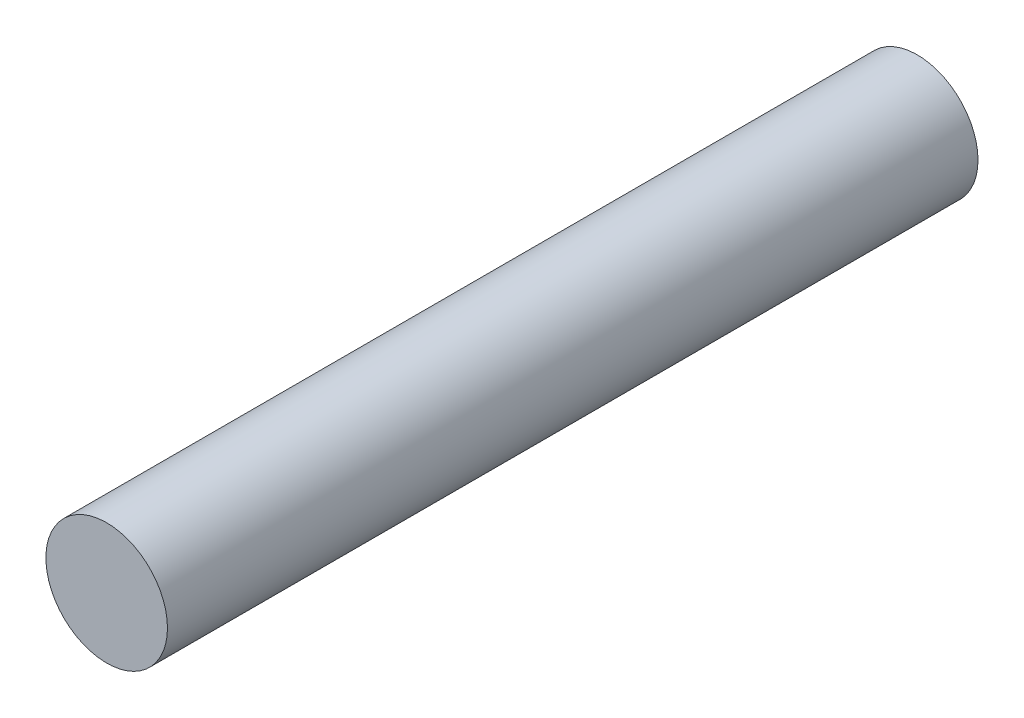
ISO-10303-21;
HEADER;
FILE_DESCRIPTION(('STEP AP214'),'2;1');
FILE_NAME('part.step','',(''),(''),'','','');
FILE_SCHEMA(('AUTOMOTIVE_DESIGN { 1 0 10303 214 1 1 1 1 }'));
ENDSEC;
DATA;
#1=APPLICATION_CONTEXT('core data for automotive mechanical design processes');
#2=APPLICATION_PROTOCOL_DEFINITION('international standard','automotive_design',2000,#1);
#3=PRODUCT_CONTEXT('',#1,'mechanical');
#4=PRODUCT('Part','Part','',(#3));
#5=PRODUCT_RELATED_PRODUCT_CATEGORY('part','',(#4));
#6=PRODUCT_DEFINITION_FORMATION('','',#4);
#7=PRODUCT_DEFINITION_CONTEXT('part definition',#1,'design');
#8=PRODUCT_DEFINITION('design','',#6,#7);
#9=PRODUCT_DEFINITION_SHAPE('','',#8);
#10=(LENGTH_UNIT() NAMED_UNIT(*) SI_UNIT(.MILLI.,.METRE.));
#11=(NAMED_UNIT(*) PLANE_ANGLE_UNIT() SI_UNIT($,.RADIAN.));
#12=(NAMED_UNIT(*) SI_UNIT($,.STERADIAN.) SOLID_ANGLE_UNIT());
#13=UNCERTAINTY_MEASURE_WITH_UNIT(LENGTH_MEASURE(1.E-05),#10,'distance_accuracy_value','');
#14=(GEOMETRIC_REPRESENTATION_CONTEXT(3) GLOBAL_UNCERTAINTY_ASSIGNED_CONTEXT((#13)) GLOBAL_UNIT_ASSIGNED_CONTEXT((#10,
#11,#12)) REPRESENTATION_CONTEXT('',''));
#15=CARTESIAN_POINT('',(0.,0.,0.));
#16=DIRECTION('',(0.,0.,1.));
#17=DIRECTION('',(1.,0.,0.));
#18=AXIS2_PLACEMENT_3D('',#15,#16,#17);
#19=CARTESIAN_POINT('',(0.,0.,20.));
#20=DIRECTION('',(0.,0.,-1.));
#21=DIRECTION('',(-1.,0.,0.));
#22=AXIS2_PLACEMENT_3D('',#19,#20,#21);
#23=CYLINDRICAL_SURFACE('',#22,1.5);
#24=CARTESIAN_POINT('',(0.,0.,20.));
#25=DIRECTION('',(0.,0.,1.));
#26=DIRECTION('',(1.,0.,0.));
#27=AXIS2_PLACEMENT_3D('',#24,#25,#26);
#28=CIRCLE('',#27,1.5);
#29=CARTESIAN_POINT('',(1.5,0.,20.));
#30=VERTEX_POINT('',#29);
#31=EDGE_CURVE('E10',#30,#30,#28,.T.);
#32=ORIENTED_EDGE('',*,*,#31,.F.);
#33=EDGE_LOOP('',(#32));
#34=FACE_BOUND('',#33,.T.);
#35=CARTESIAN_POINT('',(0.,0.,0.));
#36=DIRECTION('',(0.,0.,1.));
#37=DIRECTION('',(1.,0.,0.));
#38=AXIS2_PLACEMENT_3D('',#35,#36,#37);
#39=CIRCLE('',#38,1.5);
#40=CARTESIAN_POINT('',(1.5,0.,0.));
#41=VERTEX_POINT('',#40);
#42=EDGE_CURVE('E35',#41,#41,#39,.T.);
#43=ORIENTED_EDGE('',*,*,#42,.T.);
#44=EDGE_LOOP('',(#43));
#45=FACE_BOUND('',#44,.T.);
#46=ADVANCED_FACE('F32',(#34,#45),#23,.T.);
#47=CARTESIAN_POINT('',(0.,0.,20.));
#48=DIRECTION('',(0.,0.,1.));
#49=DIRECTION('',(1.,0.,0.));
#50=AXIS2_PLACEMENT_3D('',#47,#48,#49);
#51=PLANE('',#50);
#52=ORIENTED_EDGE('',*,*,#31,.T.);
#53=EDGE_LOOP('',(#52));
#54=FACE_BOUND('',#53,.T.);
#55=ADVANCED_FACE('F47',(#54),#51,.T.);
#56=CARTESIAN_POINT('',(0.,0.,0.));
#57=DIRECTION('',(0.,0.,1.));
#58=DIRECTION('',(1.,0.,0.));
#59=AXIS2_PLACEMENT_3D('',#56,#57,#58);
#60=PLANE('',#59);
#61=ORIENTED_EDGE('',*,*,#42,.F.);
#62=EDGE_LOOP('',(#61));
#63=FACE_BOUND('',#62,.T.);
#64=ADVANCED_FACE('F45',(#63),#60,.F.);
#65=CLOSED_SHELL('',(#46,#55,#64));
#66=MANIFOLD_SOLID_BREP('B2',#65);
#67=ADVANCED_BREP_SHAPE_REPRESENTATION('',(#18,#66),#14);
#68=SHAPE_DEFINITION_REPRESENTATION(#9,#67);
ENDSEC;
END-ISO-10303-21;
